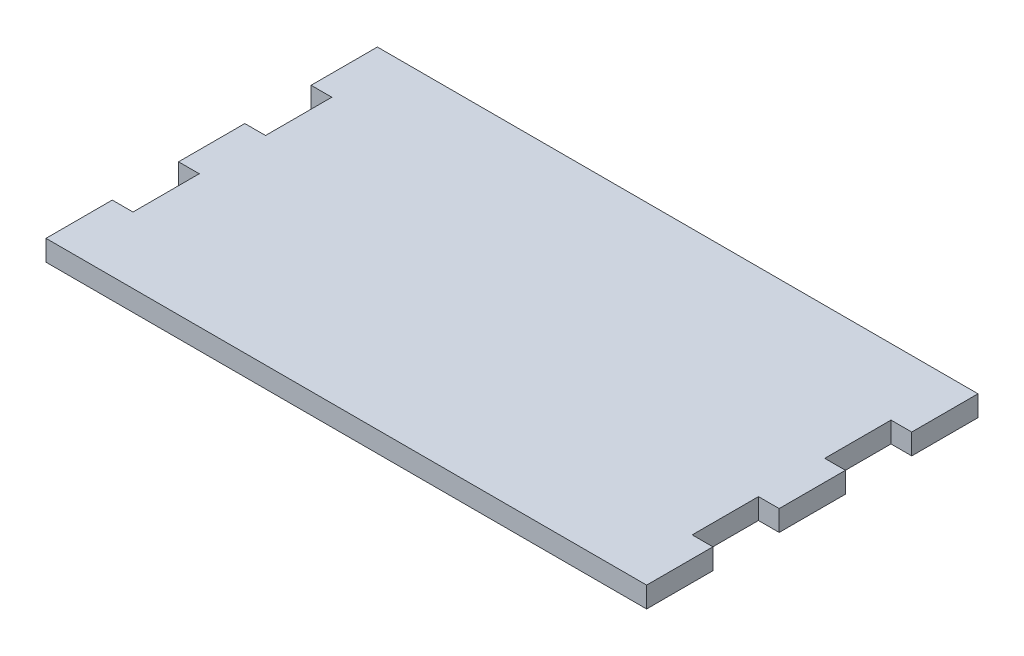
ISO-10303-21;
HEADER;
FILE_DESCRIPTION(('STEP AP214'),'2;1');
FILE_NAME('part.step','',(''),(''),'','','');
FILE_SCHEMA(('AUTOMOTIVE_DESIGN { 1 0 10303 214 1 1 1 1 }'));
ENDSEC;
DATA;
#1=APPLICATION_CONTEXT('core data for automotive mechanical design processes');
#2=APPLICATION_PROTOCOL_DEFINITION('international standard','automotive_design',2000,#1);
#3=PRODUCT_CONTEXT('',#1,'mechanical');
#4=PRODUCT('Part','Part','',(#3));
#5=PRODUCT_RELATED_PRODUCT_CATEGORY('part','',(#4));
#6=PRODUCT_DEFINITION_FORMATION('','',#4);
#7=PRODUCT_DEFINITION_CONTEXT('part definition',#1,'design');
#8=PRODUCT_DEFINITION('design','',#6,#7);
#9=PRODUCT_DEFINITION_SHAPE('','',#8);
#10=(LENGTH_UNIT() NAMED_UNIT(*) SI_UNIT(.MILLI.,.METRE.));
#11=(NAMED_UNIT(*) PLANE_ANGLE_UNIT() SI_UNIT($,.RADIAN.));
#12=(NAMED_UNIT(*) SI_UNIT($,.STERADIAN.) SOLID_ANGLE_UNIT());
#13=UNCERTAINTY_MEASURE_WITH_UNIT(LENGTH_MEASURE(1.E-05),#10,'distance_accuracy_value','');
#14=(GEOMETRIC_REPRESENTATION_CONTEXT(3) GLOBAL_UNCERTAINTY_ASSIGNED_CONTEXT((#13)) GLOBAL_UNIT_ASSIGNED_CONTEXT((#10,
#11,#12)) REPRESENTATION_CONTEXT('',''));
#15=CARTESIAN_POINT('',(0.,0.,0.));
#16=DIRECTION('',(0.,0.,1.));
#17=DIRECTION('',(1.,0.,0.));
#18=AXIS2_PLACEMENT_3D('',#15,#16,#17);
#19=CARTESIAN_POINT('',(72.5,5.,24.));
#20=DIRECTION('',(-1.,0.,0.));
#21=DIRECTION('',(0.,0.,1.));
#22=AXIS2_PLACEMENT_3D('',#19,#20,#21);
#23=PLANE('',#22);
#24=DIRECTION('',(0.,0.,-1.));
#25=VECTOR('',#24,1.);
#26=CARTESIAN_POINT('',(72.5,0.,24.));
#27=LINE('',#26,#25);
#28=CARTESIAN_POINT('',(72.5,0.,40.));
#29=VERTEX_POINT('',#28);
#30=CARTESIAN_POINT('',(72.5,0.,24.));
#31=VERTEX_POINT('',#30);
#32=EDGE_CURVE('E201',#29,#31,#27,.T.);
#33=ORIENTED_EDGE('',*,*,#32,.T.);
#34=DIRECTION('',(0.,-1.,0.));
#35=VECTOR('',#34,1.);
#36=CARTESIAN_POINT('',(72.5,5.,24.));
#37=LINE('',#36,#35);
#38=CARTESIAN_POINT('',(72.5,5.,24.));
#39=VERTEX_POINT('',#38);
#40=EDGE_CURVE('E11',#39,#31,#37,.T.);
#41=ORIENTED_EDGE('',*,*,#40,.F.);
#42=DIRECTION('',(0.,0.,-1.));
#43=VECTOR('',#42,1.);
#44=CARTESIAN_POINT('',(72.5,5.,24.));
#45=LINE('',#44,#43);
#46=CARTESIAN_POINT('',(72.5,5.,40.));
#47=VERTEX_POINT('',#46);
#48=EDGE_CURVE('E239',#47,#39,#45,.T.);
#49=ORIENTED_EDGE('',*,*,#48,.F.);
#50=DIRECTION('',(0.,-1.,0.));
#51=VECTOR('',#50,1.);
#52=CARTESIAN_POINT('',(72.5,5.,40.));
#53=LINE('',#52,#51);
#54=EDGE_CURVE('E197',#47,#29,#53,.T.);
#55=ORIENTED_EDGE('',*,*,#54,.T.);
#56=EDGE_LOOP('',(#33,#41,#49,#55));
#57=FACE_BOUND('',#56,.T.);
#58=ADVANCED_FACE('F33',(#57),#23,.F.);
#59=CARTESIAN_POINT('',(67.5,5.,24.));
#60=DIRECTION('',(0.,0.,1.));
#61=DIRECTION('',(1.,0.,0.));
#62=AXIS2_PLACEMENT_3D('',#59,#60,#61);
#63=PLANE('',#62);
#64=DIRECTION('',(-1.,0.,0.));
#65=VECTOR('',#64,1.);
#66=CARTESIAN_POINT('',(67.5,0.,24.));
#67=LINE('',#66,#65);
#68=CARTESIAN_POINT('',(67.5,0.,24.));
#69=VERTEX_POINT('',#68);
#70=EDGE_CURVE('E204',#31,#69,#67,.T.);
#71=ORIENTED_EDGE('',*,*,#70,.T.);
#72=DIRECTION('',(0.,-1.,0.));
#73=VECTOR('',#72,1.);
#74=CARTESIAN_POINT('',(67.5,5.,24.));
#75=LINE('',#74,#73);
#76=CARTESIAN_POINT('',(67.5,5.,24.));
#77=VERTEX_POINT('',#76);
#78=EDGE_CURVE('E41',#77,#69,#75,.T.);
#79=ORIENTED_EDGE('',*,*,#78,.F.);
#80=DIRECTION('',(-1.,0.,0.));
#81=VECTOR('',#80,1.);
#82=CARTESIAN_POINT('',(67.5,5.,24.));
#83=LINE('',#82,#81);
#84=EDGE_CURVE('E128',#39,#77,#83,.T.);
#85=ORIENTED_EDGE('',*,*,#84,.F.);
#86=ORIENTED_EDGE('',*,*,#40,.T.);
#87=EDGE_LOOP('',(#71,#79,#85,#86));
#88=FACE_BOUND('',#87,.T.);
#89=ADVANCED_FACE('F357',(#88),#63,.F.);
#90=CARTESIAN_POINT('',(67.5,5.,7.99999999999999));
#91=DIRECTION('',(-1.,0.,0.));
#92=DIRECTION('',(0.,0.,1.));
#93=AXIS2_PLACEMENT_3D('',#90,#91,#92);
#94=PLANE('',#93);
#95=DIRECTION('',(0.,0.,-1.));
#96=VECTOR('',#95,1.);
#97=CARTESIAN_POINT('',(67.5,0.,7.99999999999999));
#98=LINE('',#97,#96);
#99=CARTESIAN_POINT('',(67.5,0.,7.99999999999999));
#100=VERTEX_POINT('',#99);
#101=EDGE_CURVE('E206',#69,#100,#98,.T.);
#102=ORIENTED_EDGE('',*,*,#101,.T.);
#103=DIRECTION('',(0.,-1.,0.));
#104=VECTOR('',#103,1.);
#105=CARTESIAN_POINT('',(67.5,5.,7.99999999999999));
#106=LINE('',#105,#104);
#107=CARTESIAN_POINT('',(67.5,5.,7.99999999999999));
#108=VERTEX_POINT('',#107);
#109=EDGE_CURVE('E282',#108,#100,#106,.T.);
#110=ORIENTED_EDGE('',*,*,#109,.F.);
#111=DIRECTION('',(0.,0.,-1.));
#112=VECTOR('',#111,1.);
#113=CARTESIAN_POINT('',(67.5,5.,7.99999999999999));
#114=LINE('',#113,#112);
#115=EDGE_CURVE('E290',#77,#108,#114,.T.);
#116=ORIENTED_EDGE('',*,*,#115,.F.);
#117=ORIENTED_EDGE('',*,*,#78,.T.);
#118=EDGE_LOOP('',(#102,#110,#116,#117));
#119=FACE_BOUND('',#118,.T.);
#120=ADVANCED_FACE('F288',(#119),#94,.F.);
#121=CARTESIAN_POINT('',(67.5,5.,7.99999999999999));
#122=DIRECTION('',(0.,0.,-1.));
#123=DIRECTION('',(-1.,0.,0.));
#124=AXIS2_PLACEMENT_3D('',#121,#122,#123);
#125=PLANE('',#124);
#126=DIRECTION('',(1.,0.,0.));
#127=VECTOR('',#126,1.);
#128=CARTESIAN_POINT('',(67.5,0.,7.99999999999999));
#129=LINE('',#128,#127);
#130=CARTESIAN_POINT('',(72.5,0.,7.99999999999999));
#131=VERTEX_POINT('',#130);
#132=EDGE_CURVE('E208',#100,#131,#129,.T.);
#133=ORIENTED_EDGE('',*,*,#132,.T.);
#134=DIRECTION('',(0.,-1.,0.));
#135=VECTOR('',#134,1.);
#136=CARTESIAN_POINT('',(72.5,5.,7.99999999999999));
#137=LINE('',#136,#135);
#138=CARTESIAN_POINT('',(72.5,5.,7.99999999999999));
#139=VERTEX_POINT('',#138);
#140=EDGE_CURVE('E279',#139,#131,#137,.T.);
#141=ORIENTED_EDGE('',*,*,#140,.F.);
#142=DIRECTION('',(1.,0.,0.));
#143=VECTOR('',#142,1.);
#144=CARTESIAN_POINT('',(67.5,5.,7.99999999999999));
#145=LINE('',#144,#143);
#146=EDGE_CURVE('E308',#108,#139,#145,.T.);
#147=ORIENTED_EDGE('',*,*,#146,.F.);
#148=ORIENTED_EDGE('',*,*,#109,.T.);
#149=EDGE_LOOP('',(#133,#141,#147,#148));
#150=FACE_BOUND('',#149,.T.);
#151=ADVANCED_FACE('F299',(#150),#125,.F.);
#152=CARTESIAN_POINT('',(72.5,5.,-8.00000000000001));
#153=DIRECTION('',(-1.,0.,0.));
#154=DIRECTION('',(0.,0.,1.));
#155=AXIS2_PLACEMENT_3D('',#152,#153,#154);
#156=PLANE('',#155);
#157=DIRECTION('',(0.,0.,-1.));
#158=VECTOR('',#157,1.);
#159=CARTESIAN_POINT('',(72.5,0.,-8.00000000000001));
#160=LINE('',#159,#158);
#161=CARTESIAN_POINT('',(72.5,0.,-8.00000000000001));
#162=VERTEX_POINT('',#161);
#163=EDGE_CURVE('E210',#131,#162,#160,.T.);
#164=ORIENTED_EDGE('',*,*,#163,.T.);
#165=DIRECTION('',(0.,-1.,0.));
#166=VECTOR('',#165,1.);
#167=CARTESIAN_POINT('',(72.5,5.,-8.00000000000001));
#168=LINE('',#167,#166);
#169=CARTESIAN_POINT('',(72.5,5.,-8.00000000000001));
#170=VERTEX_POINT('',#169);
#171=EDGE_CURVE('E276',#170,#162,#168,.T.);
#172=ORIENTED_EDGE('',*,*,#171,.F.);
#173=DIRECTION('',(0.,0.,-1.));
#174=VECTOR('',#173,1.);
#175=CARTESIAN_POINT('',(72.5,5.,-8.00000000000001));
#176=LINE('',#175,#174);
#177=EDGE_CURVE('E305',#139,#170,#176,.T.);
#178=ORIENTED_EDGE('',*,*,#177,.F.);
#179=ORIENTED_EDGE('',*,*,#140,.T.);
#180=EDGE_LOOP('',(#164,#172,#178,#179));
#181=FACE_BOUND('',#180,.T.);
#182=ADVANCED_FACE('F303',(#181),#156,.F.);
#183=CARTESIAN_POINT('',(67.5,5.,-8.00000000000001));
#184=DIRECTION('',(0.,0.,1.));
#185=DIRECTION('',(1.,0.,0.));
#186=AXIS2_PLACEMENT_3D('',#183,#184,#185);
#187=PLANE('',#186);
#188=DIRECTION('',(-1.,0.,0.));
#189=VECTOR('',#188,1.);
#190=CARTESIAN_POINT('',(67.5,0.,-8.00000000000001));
#191=LINE('',#190,#189);
#192=CARTESIAN_POINT('',(67.5,0.,-8.00000000000001));
#193=VERTEX_POINT('',#192);
#194=EDGE_CURVE('E212',#162,#193,#191,.T.);
#195=ORIENTED_EDGE('',*,*,#194,.T.);
#196=DIRECTION('',(0.,-1.,0.));
#197=VECTOR('',#196,1.);
#198=CARTESIAN_POINT('',(67.5,5.,-8.00000000000001));
#199=LINE('',#198,#197);
#200=CARTESIAN_POINT('',(67.5,5.,-8.00000000000001));
#201=VERTEX_POINT('',#200);
#202=EDGE_CURVE('E273',#201,#193,#199,.T.);
#203=ORIENTED_EDGE('',*,*,#202,.F.);
#204=DIRECTION('',(-1.,0.,0.));
#205=VECTOR('',#204,1.);
#206=CARTESIAN_POINT('',(67.5,5.,-8.00000000000001));
#207=LINE('',#206,#205);
#208=EDGE_CURVE('E307',#170,#201,#207,.T.);
#209=ORIENTED_EDGE('',*,*,#208,.F.);
#210=ORIENTED_EDGE('',*,*,#171,.T.);
#211=EDGE_LOOP('',(#195,#203,#209,#210));
#212=FACE_BOUND('',#211,.T.);
#213=ADVANCED_FACE('F370',(#212),#187,.F.);
#214=CARTESIAN_POINT('',(67.5,5.,-24.));
#215=DIRECTION('',(-1.,0.,0.));
#216=DIRECTION('',(0.,0.,1.));
#217=AXIS2_PLACEMENT_3D('',#214,#215,#216);
#218=PLANE('',#217);
#219=DIRECTION('',(0.,0.,-1.));
#220=VECTOR('',#219,1.);
#221=CARTESIAN_POINT('',(67.5,0.,-24.));
#222=LINE('',#221,#220);
#223=CARTESIAN_POINT('',(67.5,0.,-24.));
#224=VERTEX_POINT('',#223);
#225=EDGE_CURVE('E214',#193,#224,#222,.T.);
#226=ORIENTED_EDGE('',*,*,#225,.T.);
#227=DIRECTION('',(0.,-1.,0.));
#228=VECTOR('',#227,1.);
#229=CARTESIAN_POINT('',(67.5,5.,-24.));
#230=LINE('',#229,#228);
#231=CARTESIAN_POINT('',(67.5,5.,-24.));
#232=VERTEX_POINT('',#231);
#233=EDGE_CURVE('E270',#232,#224,#230,.T.);
#234=ORIENTED_EDGE('',*,*,#233,.F.);
#235=DIRECTION('',(0.,0.,-1.));
#236=VECTOR('',#235,1.);
#237=CARTESIAN_POINT('',(67.5,5.,-24.));
#238=LINE('',#237,#236);
#239=EDGE_CURVE('E310',#201,#232,#238,.T.);
#240=ORIENTED_EDGE('',*,*,#239,.F.);
#241=ORIENTED_EDGE('',*,*,#202,.T.);
#242=EDGE_LOOP('',(#226,#234,#240,#241));
#243=FACE_BOUND('',#242,.T.);
#244=ADVANCED_FACE('F373',(#243),#218,.F.);
#245=CARTESIAN_POINT('',(67.5,5.,-24.));
#246=DIRECTION('',(0.,0.,-1.));
#247=DIRECTION('',(-1.,0.,0.));
#248=AXIS2_PLACEMENT_3D('',#245,#246,#247);
#249=PLANE('',#248);
#250=DIRECTION('',(1.,0.,0.));
#251=VECTOR('',#250,1.);
#252=CARTESIAN_POINT('',(67.5,0.,-24.));
#253=LINE('',#252,#251);
#254=CARTESIAN_POINT('',(72.5,0.,-24.));
#255=VERTEX_POINT('',#254);
#256=EDGE_CURVE('E216',#224,#255,#253,.T.);
#257=ORIENTED_EDGE('',*,*,#256,.T.);
#258=DIRECTION('',(0.,-1.,0.));
#259=VECTOR('',#258,1.);
#260=CARTESIAN_POINT('',(72.5,5.,-24.));
#261=LINE('',#260,#259);
#262=CARTESIAN_POINT('',(72.5,5.,-24.));
#263=VERTEX_POINT('',#262);
#264=EDGE_CURVE('E267',#263,#255,#261,.T.);
#265=ORIENTED_EDGE('',*,*,#264,.F.);
#266=DIRECTION('',(1.,0.,0.));
#267=VECTOR('',#266,1.);
#268=CARTESIAN_POINT('',(67.5,5.,-24.));
#269=LINE('',#268,#267);
#270=EDGE_CURVE('E316',#232,#263,#269,.T.);
#271=ORIENTED_EDGE('',*,*,#270,.F.);
#272=ORIENTED_EDGE('',*,*,#233,.T.);
#273=EDGE_LOOP('',(#257,#265,#271,#272));
#274=FACE_BOUND('',#273,.T.);
#275=ADVANCED_FACE('F377',(#274),#249,.F.);
#276=CARTESIAN_POINT('',(72.5,5.,-40.));
#277=DIRECTION('',(-1.,0.,0.));
#278=DIRECTION('',(0.,0.,1.));
#279=AXIS2_PLACEMENT_3D('',#276,#277,#278);
#280=PLANE('',#279);
#281=DIRECTION('',(0.,0.,-1.));
#282=VECTOR('',#281,1.);
#283=CARTESIAN_POINT('',(72.5,0.,-40.));
#284=LINE('',#283,#282);
#285=CARTESIAN_POINT('',(72.5,0.,-40.));
#286=VERTEX_POINT('',#285);
#287=EDGE_CURVE('E218',#255,#286,#284,.T.);
#288=ORIENTED_EDGE('',*,*,#287,.T.);
#289=DIRECTION('',(0.,-1.,0.));
#290=VECTOR('',#289,1.);
#291=CARTESIAN_POINT('',(72.5,5.,-40.));
#292=LINE('',#291,#290);
#293=CARTESIAN_POINT('',(72.5,5.,-40.));
#294=VERTEX_POINT('',#293);
#295=EDGE_CURVE('E264',#294,#286,#292,.T.);
#296=ORIENTED_EDGE('',*,*,#295,.F.);
#297=DIRECTION('',(0.,0.,-1.));
#298=VECTOR('',#297,1.);
#299=CARTESIAN_POINT('',(72.5,5.,-40.));
#300=LINE('',#299,#298);
#301=EDGE_CURVE('E318',#263,#294,#300,.T.);
#302=ORIENTED_EDGE('',*,*,#301,.F.);
#303=ORIENTED_EDGE('',*,*,#264,.T.);
#304=EDGE_LOOP('',(#288,#296,#302,#303));
#305=FACE_BOUND('',#304,.T.);
#306=ADVANCED_FACE('F381',(#305),#280,.F.);
#307=CARTESIAN_POINT('',(-72.5,5.,-40.));
#308=DIRECTION('',(0.,0.,1.));
#309=DIRECTION('',(1.,0.,0.));
#310=AXIS2_PLACEMENT_3D('',#307,#308,#309);
#311=PLANE('',#310);
#312=DIRECTION('',(-1.,0.,0.));
#313=VECTOR('',#312,1.);
#314=CARTESIAN_POINT('',(-72.5,0.,-40.));
#315=LINE('',#314,#313);
#316=CARTESIAN_POINT('',(-72.5,0.,-40.));
#317=VERTEX_POINT('',#316);
#318=EDGE_CURVE('E220',#286,#317,#315,.T.);
#319=ORIENTED_EDGE('',*,*,#318,.T.);
#320=DIRECTION('',(0.,-1.,0.));
#321=VECTOR('',#320,1.);
#322=CARTESIAN_POINT('',(-72.5,5.,-40.));
#323=LINE('',#322,#321);
#324=CARTESIAN_POINT('',(-72.5,5.,-40.));
#325=VERTEX_POINT('',#324);
#326=EDGE_CURVE('E261',#325,#317,#323,.T.);
#327=ORIENTED_EDGE('',*,*,#326,.F.);
#328=DIRECTION('',(-1.,0.,0.));
#329=VECTOR('',#328,1.);
#330=CARTESIAN_POINT('',(-72.5,5.,-40.));
#331=LINE('',#330,#329);
#332=EDGE_CURVE('E320',#294,#325,#331,.T.);
#333=ORIENTED_EDGE('',*,*,#332,.F.);
#334=ORIENTED_EDGE('',*,*,#295,.T.);
#335=EDGE_LOOP('',(#319,#327,#333,#334));
#336=FACE_BOUND('',#335,.T.);
#337=ADVANCED_FACE('F385',(#336),#311,.F.);
#338=CARTESIAN_POINT('',(-72.5,5.,-40.));
#339=DIRECTION('',(1.,0.,0.));
#340=DIRECTION('',(0.,0.,-1.));
#341=AXIS2_PLACEMENT_3D('',#338,#339,#340);
#342=PLANE('',#341);
#343=DIRECTION('',(0.,0.,1.));
#344=VECTOR('',#343,1.);
#345=CARTESIAN_POINT('',(-72.5,0.,-40.));
#346=LINE('',#345,#344);
#347=CARTESIAN_POINT('',(-72.5,0.,-24.));
#348=VERTEX_POINT('',#347);
#349=EDGE_CURVE('E222',#317,#348,#346,.T.);
#350=ORIENTED_EDGE('',*,*,#349,.T.);
#351=DIRECTION('',(0.,-1.,0.));
#352=VECTOR('',#351,1.);
#353=CARTESIAN_POINT('',(-72.5,5.,-24.));
#354=LINE('',#353,#352);
#355=CARTESIAN_POINT('',(-72.5,5.,-24.));
#356=VERTEX_POINT('',#355);
#357=EDGE_CURVE('E258',#356,#348,#354,.T.);
#358=ORIENTED_EDGE('',*,*,#357,.F.);
#359=DIRECTION('',(0.,0.,1.));
#360=VECTOR('',#359,1.);
#361=CARTESIAN_POINT('',(-72.5,5.,-40.));
#362=LINE('',#361,#360);
#363=EDGE_CURVE('E322',#325,#356,#362,.T.);
#364=ORIENTED_EDGE('',*,*,#363,.F.);
#365=ORIENTED_EDGE('',*,*,#326,.T.);
#366=EDGE_LOOP('',(#350,#358,#364,#365));
#367=FACE_BOUND('',#366,.T.);
#368=ADVANCED_FACE('F389',(#367),#342,.F.);
#369=CARTESIAN_POINT('',(-72.5,5.,-24.));
#370=DIRECTION('',(0.,0.,-1.));
#371=DIRECTION('',(-1.,0.,0.));
#372=AXIS2_PLACEMENT_3D('',#369,#370,#371);
#373=PLANE('',#372);
#374=DIRECTION('',(1.,0.,0.));
#375=VECTOR('',#374,1.);
#376=CARTESIAN_POINT('',(-72.5,0.,-24.));
#377=LINE('',#376,#375);
#378=CARTESIAN_POINT('',(-67.5,0.,-24.));
#379=VERTEX_POINT('',#378);
#380=EDGE_CURVE('E224',#348,#379,#377,.T.);
#381=ORIENTED_EDGE('',*,*,#380,.T.);
#382=DIRECTION('',(0.,-1.,0.));
#383=VECTOR('',#382,1.);
#384=CARTESIAN_POINT('',(-67.5,5.,-24.));
#385=LINE('',#384,#383);
#386=CARTESIAN_POINT('',(-67.5,5.,-24.));
#387=VERTEX_POINT('',#386);
#388=EDGE_CURVE('E255',#387,#379,#385,.T.);
#389=ORIENTED_EDGE('',*,*,#388,.F.);
#390=DIRECTION('',(1.,0.,0.));
#391=VECTOR('',#390,1.);
#392=CARTESIAN_POINT('',(-72.5,5.,-24.));
#393=LINE('',#392,#391);
#394=EDGE_CURVE('E324',#356,#387,#393,.T.);
#395=ORIENTED_EDGE('',*,*,#394,.F.);
#396=ORIENTED_EDGE('',*,*,#357,.T.);
#397=EDGE_LOOP('',(#381,#389,#395,#396));
#398=FACE_BOUND('',#397,.T.);
#399=ADVANCED_FACE('F393',(#398),#373,.F.);
#400=CARTESIAN_POINT('',(-67.5,5.,-24.));
#401=DIRECTION('',(1.,0.,0.));
#402=DIRECTION('',(0.,0.,-1.));
#403=AXIS2_PLACEMENT_3D('',#400,#401,#402);
#404=PLANE('',#403);
#405=DIRECTION('',(0.,0.,1.));
#406=VECTOR('',#405,1.);
#407=CARTESIAN_POINT('',(-67.5,0.,-24.));
#408=LINE('',#407,#406);
#409=CARTESIAN_POINT('',(-67.5,0.,-8.));
#410=VERTEX_POINT('',#409);
#411=EDGE_CURVE('E226',#379,#410,#408,.T.);
#412=ORIENTED_EDGE('',*,*,#411,.T.);
#413=DIRECTION('',(0.,-1.,0.));
#414=VECTOR('',#413,1.);
#415=CARTESIAN_POINT('',(-67.5,5.,-8.));
#416=LINE('',#415,#414);
#417=CARTESIAN_POINT('',(-67.5,5.,-8.));
#418=VERTEX_POINT('',#417);
#419=EDGE_CURVE('E252',#418,#410,#416,.T.);
#420=ORIENTED_EDGE('',*,*,#419,.F.);
#421=DIRECTION('',(0.,0.,1.));
#422=VECTOR('',#421,1.);
#423=CARTESIAN_POINT('',(-67.5,5.,-24.));
#424=LINE('',#423,#422);
#425=EDGE_CURVE('E326',#387,#418,#424,.T.);
#426=ORIENTED_EDGE('',*,*,#425,.F.);
#427=ORIENTED_EDGE('',*,*,#388,.T.);
#428=EDGE_LOOP('',(#412,#420,#426,#427));
#429=FACE_BOUND('',#428,.T.);
#430=ADVANCED_FACE('F397',(#429),#404,.F.);
#431=CARTESIAN_POINT('',(-72.5,5.,-8.));
#432=DIRECTION('',(0.,0.,1.));
#433=DIRECTION('',(1.,0.,0.));
#434=AXIS2_PLACEMENT_3D('',#431,#432,#433);
#435=PLANE('',#434);
#436=DIRECTION('',(-1.,0.,0.));
#437=VECTOR('',#436,1.);
#438=CARTESIAN_POINT('',(-72.5,0.,-8.));
#439=LINE('',#438,#437);
#440=CARTESIAN_POINT('',(-72.5,0.,-8.));
#441=VERTEX_POINT('',#440);
#442=EDGE_CURVE('E228',#410,#441,#439,.T.);
#443=ORIENTED_EDGE('',*,*,#442,.T.);
#444=DIRECTION('',(0.,-1.,0.));
#445=VECTOR('',#444,1.);
#446=CARTESIAN_POINT('',(-72.5,5.,-8.));
#447=LINE('',#446,#445);
#448=CARTESIAN_POINT('',(-72.5,5.,-8.));
#449=VERTEX_POINT('',#448);
#450=EDGE_CURVE('E249',#449,#441,#447,.T.);
#451=ORIENTED_EDGE('',*,*,#450,.F.);
#452=DIRECTION('',(-1.,0.,0.));
#453=VECTOR('',#452,1.);
#454=CARTESIAN_POINT('',(-72.5,5.,-8.));
#455=LINE('',#454,#453);
#456=EDGE_CURVE('E328',#418,#449,#455,.T.);
#457=ORIENTED_EDGE('',*,*,#456,.F.);
#458=ORIENTED_EDGE('',*,*,#419,.T.);
#459=EDGE_LOOP('',(#443,#451,#457,#458));
#460=FACE_BOUND('',#459,.T.);
#461=ADVANCED_FACE('F401',(#460),#435,.F.);
#462=CARTESIAN_POINT('',(-72.5,5.,-8.));
#463=DIRECTION('',(1.,0.,0.));
#464=DIRECTION('',(0.,0.,-1.));
#465=AXIS2_PLACEMENT_3D('',#462,#463,#464);
#466=PLANE('',#465);
#467=DIRECTION('',(0.,0.,1.));
#468=VECTOR('',#467,1.);
#469=CARTESIAN_POINT('',(-72.5,0.,-8.));
#470=LINE('',#469,#468);
#471=CARTESIAN_POINT('',(-72.5,0.,7.99999999999999));
#472=VERTEX_POINT('',#471);
#473=EDGE_CURVE('E230',#441,#472,#470,.T.);
#474=ORIENTED_EDGE('',*,*,#473,.T.);
#475=DIRECTION('',(0.,-1.,0.));
#476=VECTOR('',#475,1.);
#477=CARTESIAN_POINT('',(-72.5,5.,7.99999999999999));
#478=LINE('',#477,#476);
#479=CARTESIAN_POINT('',(-72.5,5.,7.99999999999999));
#480=VERTEX_POINT('',#479);
#481=EDGE_CURVE('E246',#480,#472,#478,.T.);
#482=ORIENTED_EDGE('',*,*,#481,.F.);
#483=DIRECTION('',(0.,0.,1.));
#484=VECTOR('',#483,1.);
#485=CARTESIAN_POINT('',(-72.5,5.,-8.));
#486=LINE('',#485,#484);
#487=EDGE_CURVE('E330',#449,#480,#486,.T.);
#488=ORIENTED_EDGE('',*,*,#487,.F.);
#489=ORIENTED_EDGE('',*,*,#450,.T.);
#490=EDGE_LOOP('',(#474,#482,#488,#489));
#491=FACE_BOUND('',#490,.T.);
#492=ADVANCED_FACE('F405',(#491),#466,.F.);
#493=CARTESIAN_POINT('',(-72.5,5.,7.99999999999999));
#494=DIRECTION('',(0.,0.,-1.));
#495=DIRECTION('',(-1.,0.,0.));
#496=AXIS2_PLACEMENT_3D('',#493,#494,#495);
#497=PLANE('',#496);
#498=DIRECTION('',(1.,0.,0.));
#499=VECTOR('',#498,1.);
#500=CARTESIAN_POINT('',(-72.5,0.,7.99999999999999));
#501=LINE('',#500,#499);
#502=CARTESIAN_POINT('',(-67.5,0.,7.99999999999999));
#503=VERTEX_POINT('',#502);
#504=EDGE_CURVE('E232',#472,#503,#501,.T.);
#505=ORIENTED_EDGE('',*,*,#504,.T.);
#506=DIRECTION('',(0.,-1.,0.));
#507=VECTOR('',#506,1.);
#508=CARTESIAN_POINT('',(-67.5,5.,7.99999999999999));
#509=LINE('',#508,#507);
#510=CARTESIAN_POINT('',(-67.5,5.,7.99999999999999));
#511=VERTEX_POINT('',#510);
#512=EDGE_CURVE('E243',#511,#503,#509,.T.);
#513=ORIENTED_EDGE('',*,*,#512,.F.);
#514=DIRECTION('',(1.,0.,0.));
#515=VECTOR('',#514,1.);
#516=CARTESIAN_POINT('',(-72.5,5.,7.99999999999999));
#517=LINE('',#516,#515);
#518=EDGE_CURVE('E332',#480,#511,#517,.T.);
#519=ORIENTED_EDGE('',*,*,#518,.F.);
#520=ORIENTED_EDGE('',*,*,#481,.T.);
#521=EDGE_LOOP('',(#505,#513,#519,#520));
#522=FACE_BOUND('',#521,.T.);
#523=ADVANCED_FACE('F338',(#522),#497,.F.);
#524=CARTESIAN_POINT('',(-67.5,5.,7.99999999999999));
#525=DIRECTION('',(1.,0.,0.));
#526=DIRECTION('',(0.,0.,-1.));
#527=AXIS2_PLACEMENT_3D('',#524,#525,#526);
#528=PLANE('',#527);
#529=DIRECTION('',(0.,0.,1.));
#530=VECTOR('',#529,1.);
#531=CARTESIAN_POINT('',(-67.5,0.,7.99999999999999));
#532=LINE('',#531,#530);
#533=CARTESIAN_POINT('',(-67.5,0.,24.));
#534=VERTEX_POINT('',#533);
#535=EDGE_CURVE('E234',#503,#534,#532,.T.);
#536=ORIENTED_EDGE('',*,*,#535,.T.);
#537=DIRECTION('',(0.,-1.,0.));
#538=VECTOR('',#537,1.);
#539=CARTESIAN_POINT('',(-67.5,5.,24.));
#540=LINE('',#539,#538);
#541=CARTESIAN_POINT('',(-67.5,5.,24.));
#542=VERTEX_POINT('',#541);
#543=EDGE_CURVE('E192',#542,#534,#540,.T.);
#544=ORIENTED_EDGE('',*,*,#543,.F.);
#545=DIRECTION('',(0.,0.,1.));
#546=VECTOR('',#545,1.);
#547=CARTESIAN_POINT('',(-67.5,5.,7.99999999999999));
#548=LINE('',#547,#546);
#549=EDGE_CURVE('E183',#511,#542,#548,.T.);
#550=ORIENTED_EDGE('',*,*,#549,.F.);
#551=ORIENTED_EDGE('',*,*,#512,.T.);
#552=EDGE_LOOP('',(#536,#544,#550,#551));
#553=FACE_BOUND('',#552,.T.);
#554=ADVANCED_FACE('F342',(#553),#528,.F.);
#555=CARTESIAN_POINT('',(-72.5,5.,24.));
#556=DIRECTION('',(0.,0.,1.));
#557=DIRECTION('',(1.,0.,0.));
#558=AXIS2_PLACEMENT_3D('',#555,#556,#557);
#559=PLANE('',#558);
#560=DIRECTION('',(-1.,0.,0.));
#561=VECTOR('',#560,1.);
#562=CARTESIAN_POINT('',(-72.5,0.,24.));
#563=LINE('',#562,#561);
#564=CARTESIAN_POINT('',(-72.5,0.,24.));
#565=VERTEX_POINT('',#564);
#566=EDGE_CURVE('E191',#534,#565,#563,.T.);
#567=ORIENTED_EDGE('',*,*,#566,.T.);
#568=DIRECTION('',(0.,-1.,0.));
#569=VECTOR('',#568,1.);
#570=CARTESIAN_POINT('',(-72.5,5.,24.));
#571=LINE('',#570,#569);
#572=CARTESIAN_POINT('',(-72.5,5.,24.));
#573=VERTEX_POINT('',#572);
#574=EDGE_CURVE('E188',#573,#565,#571,.T.);
#575=ORIENTED_EDGE('',*,*,#574,.F.);
#576=DIRECTION('',(-1.,0.,0.));
#577=VECTOR('',#576,1.);
#578=CARTESIAN_POINT('',(-72.5,5.,24.));
#579=LINE('',#578,#577);
#580=EDGE_CURVE('E177',#542,#573,#579,.T.);
#581=ORIENTED_EDGE('',*,*,#580,.F.);
#582=ORIENTED_EDGE('',*,*,#543,.T.);
#583=EDGE_LOOP('',(#567,#575,#581,#582));
#584=FACE_BOUND('',#583,.T.);
#585=ADVANCED_FACE('F189',(#584),#559,.F.);
#586=CARTESIAN_POINT('',(-72.5,5.,24.));
#587=DIRECTION('',(1.,0.,0.));
#588=DIRECTION('',(0.,0.,-1.));
#589=AXIS2_PLACEMENT_3D('',#586,#587,#588);
#590=PLANE('',#589);
#591=DIRECTION('',(0.,0.,1.));
#592=VECTOR('',#591,1.);
#593=CARTESIAN_POINT('',(-72.5,0.,24.));
#594=LINE('',#593,#592);
#595=CARTESIAN_POINT('',(-72.5,0.,40.));
#596=VERTEX_POINT('',#595);
#597=EDGE_CURVE('E114',#565,#596,#594,.T.);
#598=ORIENTED_EDGE('',*,*,#597,.T.);
#599=DIRECTION('',(0.,-1.,0.));
#600=VECTOR('',#599,1.);
#601=CARTESIAN_POINT('',(-72.5,5.,40.));
#602=LINE('',#601,#600);
#603=CARTESIAN_POINT('',(-72.5,5.,40.));
#604=VERTEX_POINT('',#603);
#605=EDGE_CURVE('E193',#604,#596,#602,.T.);
#606=ORIENTED_EDGE('',*,*,#605,.F.);
#607=DIRECTION('',(0.,0.,1.));
#608=VECTOR('',#607,1.);
#609=CARTESIAN_POINT('',(-72.5,5.,24.));
#610=LINE('',#609,#608);
#611=EDGE_CURVE('E181',#573,#604,#610,.T.);
#612=ORIENTED_EDGE('',*,*,#611,.F.);
#613=ORIENTED_EDGE('',*,*,#574,.T.);
#614=EDGE_LOOP('',(#598,#606,#612,#613));
#615=FACE_BOUND('',#614,.T.);
#616=ADVANCED_FACE('F195',(#615),#590,.F.);
#617=CARTESIAN_POINT('',(-72.5,5.,40.));
#618=DIRECTION('',(0.,0.,-1.));
#619=DIRECTION('',(-1.,0.,0.));
#620=AXIS2_PLACEMENT_3D('',#617,#618,#619);
#621=PLANE('',#620);
#622=DIRECTION('',(1.,0.,0.));
#623=VECTOR('',#622,1.);
#624=CARTESIAN_POINT('',(-72.5,0.,40.));
#625=LINE('',#624,#623);
#626=EDGE_CURVE('E120',#596,#29,#625,.T.);
#627=ORIENTED_EDGE('',*,*,#626,.T.);
#628=ORIENTED_EDGE('',*,*,#54,.F.);
#629=DIRECTION('',(1.,0.,0.));
#630=VECTOR('',#629,1.);
#631=CARTESIAN_POINT('',(-72.5,5.,40.));
#632=LINE('',#631,#630);
#633=EDGE_CURVE('E49',#604,#47,#632,.T.);
#634=ORIENTED_EDGE('',*,*,#633,.F.);
#635=ORIENTED_EDGE('',*,*,#605,.T.);
#636=EDGE_LOOP('',(#627,#628,#634,#635));
#637=FACE_BOUND('',#636,.T.);
#638=ADVANCED_FACE('F346',(#637),#621,.F.);
#639=CARTESIAN_POINT('',(0.,5.,0.));
#640=DIRECTION('',(0.,1.,0.));
#641=DIRECTION('',(0.,0.,1.));
#642=AXIS2_PLACEMENT_3D('',#639,#640,#641);
#643=PLANE('',#642);
#644=ORIENTED_EDGE('',*,*,#48,.T.);
#645=ORIENTED_EDGE('',*,*,#84,.T.);
#646=ORIENTED_EDGE('',*,*,#115,.T.);
#647=ORIENTED_EDGE('',*,*,#146,.T.);
#648=ORIENTED_EDGE('',*,*,#177,.T.);
#649=ORIENTED_EDGE('',*,*,#208,.T.);
#650=ORIENTED_EDGE('',*,*,#239,.T.);
#651=ORIENTED_EDGE('',*,*,#270,.T.);
#652=ORIENTED_EDGE('',*,*,#301,.T.);
#653=ORIENTED_EDGE('',*,*,#332,.T.);
#654=ORIENTED_EDGE('',*,*,#363,.T.);
#655=ORIENTED_EDGE('',*,*,#394,.T.);
#656=ORIENTED_EDGE('',*,*,#425,.T.);
#657=ORIENTED_EDGE('',*,*,#456,.T.);
#658=ORIENTED_EDGE('',*,*,#487,.T.);
#659=ORIENTED_EDGE('',*,*,#518,.T.);
#660=ORIENTED_EDGE('',*,*,#549,.T.);
#661=ORIENTED_EDGE('',*,*,#580,.T.);
#662=ORIENTED_EDGE('',*,*,#611,.T.);
#663=ORIENTED_EDGE('',*,*,#633,.T.);
#664=EDGE_LOOP('',(#644,#645,#646,#647,#648,#649,#650,#651,#652,#653,#654,#655,#656,#657,#658,
#659,#660,#661,#662,#663));
#665=FACE_BOUND('',#664,.T.);
#666=ADVANCED_FACE('F179',(#665),#643,.T.);
#667=CARTESIAN_POINT('',(0.,0.,0.));
#668=DIRECTION('',(0.,1.,0.));
#669=DIRECTION('',(0.,0.,1.));
#670=AXIS2_PLACEMENT_3D('',#667,#668,#669);
#671=PLANE('',#670);
#672=ORIENTED_EDGE('',*,*,#32,.F.);
#673=ORIENTED_EDGE('',*,*,#626,.F.);
#674=ORIENTED_EDGE('',*,*,#597,.F.);
#675=ORIENTED_EDGE('',*,*,#566,.F.);
#676=ORIENTED_EDGE('',*,*,#535,.F.);
#677=ORIENTED_EDGE('',*,*,#504,.F.);
#678=ORIENTED_EDGE('',*,*,#473,.F.);
#679=ORIENTED_EDGE('',*,*,#442,.F.);
#680=ORIENTED_EDGE('',*,*,#411,.F.);
#681=ORIENTED_EDGE('',*,*,#380,.F.);
#682=ORIENTED_EDGE('',*,*,#349,.F.);
#683=ORIENTED_EDGE('',*,*,#318,.F.);
#684=ORIENTED_EDGE('',*,*,#287,.F.);
#685=ORIENTED_EDGE('',*,*,#256,.F.);
#686=ORIENTED_EDGE('',*,*,#225,.F.);
#687=ORIENTED_EDGE('',*,*,#194,.F.);
#688=ORIENTED_EDGE('',*,*,#163,.F.);
#689=ORIENTED_EDGE('',*,*,#132,.F.);
#690=ORIENTED_EDGE('',*,*,#101,.F.);
#691=ORIENTED_EDGE('',*,*,#70,.F.);
#692=EDGE_LOOP('',(#672,#673,#674,#675,#676,#677,#678,#679,#680,#681,#682,#683,#684,#685,#686,
#687,#688,#689,#690,#691));
#693=FACE_BOUND('',#692,.T.);
#694=ADVANCED_FACE('F294',(#693),#671,.F.);
#695=CLOSED_SHELL('',(#58,#89,#120,#151,#182,#213,#244,#275,#306,#337,#368,#399,#430,#461,#492,
#523,#554,#585,#616,#638,#666,#694));
#696=MANIFOLD_SOLID_BREP('B2',#695);
#697=ADVANCED_BREP_SHAPE_REPRESENTATION('',(#18,#696),#14);
#698=SHAPE_DEFINITION_REPRESENTATION(#9,#697);
ENDSEC;
END-ISO-10303-21;
